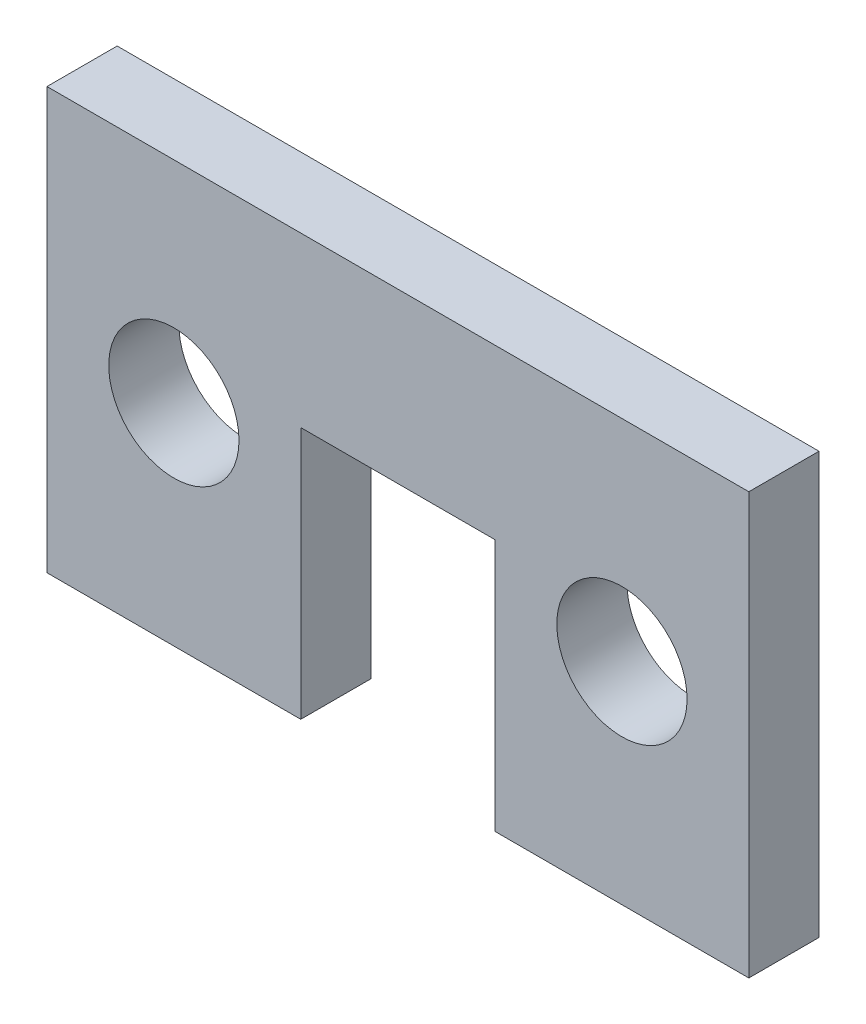
ISO-10303-21;
HEADER;
FILE_DESCRIPTION(('STEP AP214'),'2;1');
FILE_NAME('part.step','',(''),(''),'','','');
FILE_SCHEMA(('AUTOMOTIVE_DESIGN { 1 0 10303 214 1 1 1 1 }'));
ENDSEC;
DATA;
#1=APPLICATION_CONTEXT('core data for automotive mechanical design processes');
#2=APPLICATION_PROTOCOL_DEFINITION('international standard','automotive_design',2000,#1);
#3=PRODUCT_CONTEXT('',#1,'mechanical');
#4=PRODUCT('Part','Part','',(#3));
#5=PRODUCT_RELATED_PRODUCT_CATEGORY('part','',(#4));
#6=PRODUCT_DEFINITION_FORMATION('','',#4);
#7=PRODUCT_DEFINITION_CONTEXT('part definition',#1,'design');
#8=PRODUCT_DEFINITION('design','',#6,#7);
#9=PRODUCT_DEFINITION_SHAPE('','',#8);
#10=(LENGTH_UNIT() NAMED_UNIT(*) SI_UNIT(.MILLI.,.METRE.));
#11=(NAMED_UNIT(*) PLANE_ANGLE_UNIT() SI_UNIT($,.RADIAN.));
#12=(NAMED_UNIT(*) SI_UNIT($,.STERADIAN.) SOLID_ANGLE_UNIT());
#13=UNCERTAINTY_MEASURE_WITH_UNIT(LENGTH_MEASURE(1.E-05),#10,'distance_accuracy_value','');
#14=(GEOMETRIC_REPRESENTATION_CONTEXT(3) GLOBAL_UNCERTAINTY_ASSIGNED_CONTEXT((#13)) GLOBAL_UNIT_ASSIGNED_CONTEXT((#10,
#11,#12)) REPRESENTATION_CONTEXT('',''));
#15=CARTESIAN_POINT('',(0.,0.,0.));
#16=DIRECTION('',(0.,0.,1.));
#17=DIRECTION('',(1.,0.,0.));
#18=AXIS2_PLACEMENT_3D('',#15,#16,#17);
#19=CARTESIAN_POINT('',(-2.19709999999999,2.85749999999999,-1.5875));
#20=DIRECTION('',(-1.,0.,0.));
#21=DIRECTION('',(0.,-1.,0.));
#22=AXIS2_PLACEMENT_3D('',#19,#20,#21);
#23=PLANE('',#22);
#24=DIRECTION('',(0.,1.,0.));
#25=VECTOR('',#24,1.);
#26=CARTESIAN_POINT('',(-2.19709999999999,2.85749999999999,0.));
#27=LINE('',#26,#25);
#28=CARTESIAN_POINT('',(-2.19709999999999,-2.85750000000001,0.));
#29=VERTEX_POINT('',#28);
#30=CARTESIAN_POINT('',(-2.19709999999999,2.85749999999999,0.));
#31=VERTEX_POINT('',#30);
#32=EDGE_CURVE('E128',#29,#31,#27,.T.);
#33=ORIENTED_EDGE('',*,*,#32,.F.);
#34=DIRECTION('',(0.,0.,1.));
#35=VECTOR('',#34,1.);
#36=CARTESIAN_POINT('',(-2.19709999999999,-2.85750000000001,-1.5875));
#37=LINE('',#36,#35);
#38=CARTESIAN_POINT('',(-2.19709999999999,-2.85750000000001,-1.5875));
#39=VERTEX_POINT('',#38);
#40=EDGE_CURVE('E127',#39,#29,#37,.T.);
#41=ORIENTED_EDGE('',*,*,#40,.F.);
#42=DIRECTION('',(0.,1.,0.));
#43=VECTOR('',#42,1.);
#44=CARTESIAN_POINT('',(-2.19709999999999,2.85749999999999,-1.5875));
#45=LINE('',#44,#43);
#46=CARTESIAN_POINT('',(-2.19709999999999,2.85749999999999,-1.5875));
#47=VERTEX_POINT('',#46);
#48=EDGE_CURVE('E147',#39,#47,#45,.T.);
#49=ORIENTED_EDGE('',*,*,#48,.T.);
#50=DIRECTION('',(0.,0.,1.));
#51=VECTOR('',#50,1.);
#52=CARTESIAN_POINT('',(-2.19709999999999,2.85749999999999,-1.5875));
#53=LINE('',#52,#51);
#54=EDGE_CURVE('E11',#47,#31,#53,.T.);
#55=ORIENTED_EDGE('',*,*,#54,.T.);
#56=EDGE_LOOP('',(#33,#41,#49,#55));
#57=FACE_BOUND('',#56,.T.);
#58=ADVANCED_FACE('F32',(#57),#23,.F.);
#59=CARTESIAN_POINT('',(-2.19709999999999,2.85749999999999,-1.5875));
#60=DIRECTION('',(0.,1.,0.));
#61=DIRECTION('',(0.,0.,-1.));
#62=AXIS2_PLACEMENT_3D('',#59,#60,#61);
#63=PLANE('',#62);
#64=DIRECTION('',(1.,0.,0.));
#65=VECTOR('',#64,1.);
#66=CARTESIAN_POINT('',(-2.19709999999999,2.85749999999999,0.));
#67=LINE('',#66,#65);
#68=CARTESIAN_POINT('',(2.19710000000001,2.85749999999999,0.));
#69=VERTEX_POINT('',#68);
#70=EDGE_CURVE('E130',#31,#69,#67,.T.);
#71=ORIENTED_EDGE('',*,*,#70,.F.);
#72=ORIENTED_EDGE('',*,*,#54,.F.);
#73=DIRECTION('',(1.,0.,0.));
#74=VECTOR('',#73,1.);
#75=CARTESIAN_POINT('',(-2.19709999999999,2.85749999999999,-1.5875));
#76=LINE('',#75,#74);
#77=CARTESIAN_POINT('',(2.19710000000001,2.85749999999999,-1.5875));
#78=VERTEX_POINT('',#77);
#79=EDGE_CURVE('E86',#47,#78,#76,.T.);
#80=ORIENTED_EDGE('',*,*,#79,.T.);
#81=DIRECTION('',(0.,0.,1.));
#82=VECTOR('',#81,1.);
#83=CARTESIAN_POINT('',(2.19710000000001,2.85749999999999,-1.5875));
#84=LINE('',#83,#82);
#85=EDGE_CURVE('E40',#78,#69,#84,.T.);
#86=ORIENTED_EDGE('',*,*,#85,.T.);
#87=EDGE_LOOP('',(#71,#72,#80,#86));
#88=FACE_BOUND('',#87,.T.);
#89=ADVANCED_FACE('F159',(#88),#63,.F.);
#90=CARTESIAN_POINT('',(2.19710000000001,2.85749999999999,-1.5875));
#91=DIRECTION('',(1.,0.,0.));
#92=DIRECTION('',(0.,1.,0.));
#93=AXIS2_PLACEMENT_3D('',#90,#91,#92);
#94=PLANE('',#93);
#95=DIRECTION('',(0.,-1.,0.));
#96=VECTOR('',#95,1.);
#97=CARTESIAN_POINT('',(2.19710000000001,2.85749999999999,0.));
#98=LINE('',#97,#96);
#99=CARTESIAN_POINT('',(2.19710000000001,-2.85750000000001,0.));
#100=VERTEX_POINT('',#99);
#101=EDGE_CURVE('E134',#69,#100,#98,.T.);
#102=ORIENTED_EDGE('',*,*,#101,.F.);
#103=ORIENTED_EDGE('',*,*,#85,.F.);
#104=DIRECTION('',(0.,-1.,0.));
#105=VECTOR('',#104,1.);
#106=CARTESIAN_POINT('',(2.19710000000001,2.85749999999999,-1.5875));
#107=LINE('',#106,#105);
#108=CARTESIAN_POINT('',(2.19710000000001,-2.85750000000001,-1.5875));
#109=VERTEX_POINT('',#108);
#110=EDGE_CURVE('E168',#78,#109,#107,.T.);
#111=ORIENTED_EDGE('',*,*,#110,.T.);
#112=DIRECTION('',(0.,0.,1.));
#113=VECTOR('',#112,1.);
#114=CARTESIAN_POINT('',(2.19710000000001,-2.85750000000001,-1.5875));
#115=LINE('',#114,#113);
#116=EDGE_CURVE('E154',#109,#100,#115,.T.);
#117=ORIENTED_EDGE('',*,*,#116,.T.);
#118=EDGE_LOOP('',(#102,#103,#111,#117));
#119=FACE_BOUND('',#118,.T.);
#120=ADVANCED_FACE('F180',(#119),#94,.F.);
#121=CARTESIAN_POINT('',(2.19710000000001,-2.85750000000001,-1.5875));
#122=DIRECTION('',(0.,1.,0.));
#123=DIRECTION('',(-1.,0.,0.));
#124=AXIS2_PLACEMENT_3D('',#121,#122,#123);
#125=PLANE('',#124);
#126=DIRECTION('',(1.,0.,0.));
#127=VECTOR('',#126,1.);
#128=CARTESIAN_POINT('',(2.19710000000001,-2.85750000000001,0.));
#129=LINE('',#128,#127);
#130=CARTESIAN_POINT('',(7.93750000000001,-2.8575,0.));
#131=VERTEX_POINT('',#130);
#132=EDGE_CURVE('E137',#100,#131,#129,.T.);
#133=ORIENTED_EDGE('',*,*,#132,.F.);
#134=ORIENTED_EDGE('',*,*,#116,.F.);
#135=DIRECTION('',(1.,0.,0.));
#136=VECTOR('',#135,1.);
#137=CARTESIAN_POINT('',(2.19710000000001,-2.85750000000001,-1.5875));
#138=LINE('',#137,#136);
#139=CARTESIAN_POINT('',(7.93750000000001,-2.8575,-1.5875));
#140=VERTEX_POINT('',#139);
#141=EDGE_CURVE('E122',#109,#140,#138,.T.);
#142=ORIENTED_EDGE('',*,*,#141,.T.);
#143=DIRECTION('',(0.,0.,1.));
#144=VECTOR('',#143,1.);
#145=CARTESIAN_POINT('',(7.93750000000001,-2.8575,-1.5875));
#146=LINE('',#145,#144);
#147=EDGE_CURVE('E151',#140,#131,#146,.T.);
#148=ORIENTED_EDGE('',*,*,#147,.T.);
#149=EDGE_LOOP('',(#133,#134,#142,#148));
#150=FACE_BOUND('',#149,.T.);
#151=ADVANCED_FACE('F176',(#150),#125,.F.);
#152=CARTESIAN_POINT('',(7.93750000000001,-2.8575,-1.5875));
#153=DIRECTION('',(-1.,0.,0.));
#154=DIRECTION('',(0.,0.,-1.));
#155=AXIS2_PLACEMENT_3D('',#152,#153,#154);
#156=PLANE('',#155);
#157=DIRECTION('',(0.,1.,0.));
#158=VECTOR('',#157,1.);
#159=CARTESIAN_POINT('',(7.93750000000001,-2.8575,0.));
#160=LINE('',#159,#158);
#161=CARTESIAN_POINT('',(7.93750000000001,6.66749999999999,0.));
#162=VERTEX_POINT('',#161);
#163=EDGE_CURVE('E140',#131,#162,#160,.T.);
#164=ORIENTED_EDGE('',*,*,#163,.F.);
#165=ORIENTED_EDGE('',*,*,#147,.F.);
#166=DIRECTION('',(0.,1.,0.));
#167=VECTOR('',#166,1.);
#168=CARTESIAN_POINT('',(7.93750000000001,-2.8575,-1.5875));
#169=LINE('',#168,#167);
#170=CARTESIAN_POINT('',(7.93750000000001,6.66749999999999,-1.5875));
#171=VERTEX_POINT('',#170);
#172=EDGE_CURVE('E120',#140,#171,#169,.T.);
#173=ORIENTED_EDGE('',*,*,#172,.T.);
#174=DIRECTION('',(0.,0.,1.));
#175=VECTOR('',#174,1.);
#176=CARTESIAN_POINT('',(7.93750000000001,6.66749999999999,-1.5875));
#177=LINE('',#176,#175);
#178=EDGE_CURVE('E114',#171,#162,#177,.T.);
#179=ORIENTED_EDGE('',*,*,#178,.T.);
#180=EDGE_LOOP('',(#164,#165,#173,#179));
#181=FACE_BOUND('',#180,.T.);
#182=ADVANCED_FACE('F179',(#181),#156,.F.);
#183=CARTESIAN_POINT('',(-7.93749999999999,6.66749999999999,-1.5875));
#184=DIRECTION('',(0.,-1.,0.));
#185=DIRECTION('',(0.,0.,1.));
#186=AXIS2_PLACEMENT_3D('',#183,#184,#185);
#187=PLANE('',#186);
#188=DIRECTION('',(-1.,0.,0.));
#189=VECTOR('',#188,1.);
#190=CARTESIAN_POINT('',(-7.93749999999999,6.66749999999999,0.));
#191=LINE('',#190,#189);
#192=CARTESIAN_POINT('',(-7.93749999999999,6.66749999999999,0.));
#193=VERTEX_POINT('',#192);
#194=EDGE_CURVE('E143',#162,#193,#191,.T.);
#195=ORIENTED_EDGE('',*,*,#194,.F.);
#196=ORIENTED_EDGE('',*,*,#178,.F.);
#197=DIRECTION('',(-1.,0.,0.));
#198=VECTOR('',#197,1.);
#199=CARTESIAN_POINT('',(-7.93749999999999,6.66749999999999,-1.5875));
#200=LINE('',#199,#198);
#201=CARTESIAN_POINT('',(-7.93749999999999,6.66749999999999,-1.5875));
#202=VERTEX_POINT('',#201);
#203=EDGE_CURVE('E104',#171,#202,#200,.T.);
#204=ORIENTED_EDGE('',*,*,#203,.T.);
#205=DIRECTION('',(0.,0.,1.));
#206=VECTOR('',#205,1.);
#207=CARTESIAN_POINT('',(-7.93749999999999,6.66749999999999,-1.5875));
#208=LINE('',#207,#206);
#209=EDGE_CURVE('E109',#202,#193,#208,.T.);
#210=ORIENTED_EDGE('',*,*,#209,.T.);
#211=EDGE_LOOP('',(#195,#196,#204,#210));
#212=FACE_BOUND('',#211,.T.);
#213=ADVANCED_FACE('F117',(#212),#187,.F.);
#214=CARTESIAN_POINT('',(-7.93749999999999,-2.8575,-1.5875));
#215=DIRECTION('',(1.,0.,0.));
#216=DIRECTION('',(0.,0.,1.));
#217=AXIS2_PLACEMENT_3D('',#214,#215,#216);
#218=PLANE('',#217);
#219=DIRECTION('',(0.,-1.,0.));
#220=VECTOR('',#219,1.);
#221=CARTESIAN_POINT('',(-7.93749999999999,-2.8575,0.));
#222=LINE('',#221,#220);
#223=CARTESIAN_POINT('',(-7.93749999999999,-2.8575,0.));
#224=VERTEX_POINT('',#223);
#225=EDGE_CURVE('E111',#193,#224,#222,.T.);
#226=ORIENTED_EDGE('',*,*,#225,.F.);
#227=ORIENTED_EDGE('',*,*,#209,.F.);
#228=DIRECTION('',(0.,-1.,0.));
#229=VECTOR('',#228,1.);
#230=CARTESIAN_POINT('',(-7.93749999999999,-2.8575,-1.5875));
#231=LINE('',#230,#229);
#232=CARTESIAN_POINT('',(-7.93749999999999,-2.8575,-1.5875));
#233=VERTEX_POINT('',#232);
#234=EDGE_CURVE('E100',#202,#233,#231,.T.);
#235=ORIENTED_EDGE('',*,*,#234,.T.);
#236=DIRECTION('',(0.,0.,1.));
#237=VECTOR('',#236,1.);
#238=CARTESIAN_POINT('',(-7.93749999999999,-2.8575,-1.5875));
#239=LINE('',#238,#237);
#240=EDGE_CURVE('E115',#233,#224,#239,.T.);
#241=ORIENTED_EDGE('',*,*,#240,.T.);
#242=EDGE_LOOP('',(#226,#227,#235,#241));
#243=FACE_BOUND('',#242,.T.);
#244=ADVANCED_FACE('F110',(#243),#218,.F.);
#245=CARTESIAN_POINT('',(-2.19709999999999,-2.85750000000001,-1.5875));
#246=DIRECTION('',(0.,1.,0.));
#247=DIRECTION('',(-1.,0.,0.));
#248=AXIS2_PLACEMENT_3D('',#245,#246,#247);
#249=PLANE('',#248);
#250=DIRECTION('',(1.,0.,0.));
#251=VECTOR('',#250,1.);
#252=CARTESIAN_POINT('',(-2.19709999999999,-2.85750000000001,0.));
#253=LINE('',#252,#251);
#254=EDGE_CURVE('E74',#224,#29,#253,.T.);
#255=ORIENTED_EDGE('',*,*,#254,.F.);
#256=ORIENTED_EDGE('',*,*,#240,.F.);
#257=DIRECTION('',(1.,0.,0.));
#258=VECTOR('',#257,1.);
#259=CARTESIAN_POINT('',(-2.19709999999999,-2.85750000000001,-1.5875));
#260=LINE('',#259,#258);
#261=EDGE_CURVE('E48',#233,#39,#260,.T.);
#262=ORIENTED_EDGE('',*,*,#261,.T.);
#263=ORIENTED_EDGE('',*,*,#40,.T.);
#264=EDGE_LOOP('',(#255,#256,#262,#263));
#265=FACE_BOUND('',#264,.T.);
#266=ADVANCED_FACE('F230',(#265),#249,.F.);
#267=CARTESIAN_POINT('',(-2.19709999999999,-2.85750000000001,-1.5875));
#268=DIRECTION('',(0.,0.,1.));
#269=DIRECTION('',(-1.,0.,0.));
#270=AXIS2_PLACEMENT_3D('',#267,#268,#269);
#271=PLANE('',#270);
#272=CARTESIAN_POINT('',(-5.06729999999999,1.90499999999999,-1.5875));
#273=DIRECTION('',(0.,0.,1.));
#274=DIRECTION('',(1.,0.,0.));
#275=AXIS2_PLACEMENT_3D('',#272,#273,#274);
#276=CIRCLE('',#275,1.47319999999999);
#277=CARTESIAN_POINT('',(-3.5941,1.90499999999999,-1.5875));
#278=VERTEX_POINT('',#277);
#279=EDGE_CURVE('E286',#278,#278,#276,.T.);
#280=ORIENTED_EDGE('',*,*,#279,.T.);
#281=EDGE_LOOP('',(#280));
#282=FACE_BOUND('',#281,.T.);
#283=CARTESIAN_POINT('',(5.06730000000001,1.90499999999999,-1.5875));
#284=DIRECTION('',(0.,0.,1.));
#285=DIRECTION('',(1.,0.,0.));
#286=AXIS2_PLACEMENT_3D('',#283,#284,#285);
#287=CIRCLE('',#286,1.47319999999999);
#288=CARTESIAN_POINT('',(6.5405,1.90499999999999,-1.5875));
#289=VERTEX_POINT('',#288);
#290=EDGE_CURVE('E288',#289,#289,#287,.T.);
#291=ORIENTED_EDGE('',*,*,#290,.T.);
#292=EDGE_LOOP('',(#291));
#293=FACE_BOUND('',#292,.T.);
#294=ORIENTED_EDGE('',*,*,#48,.F.);
#295=ORIENTED_EDGE('',*,*,#261,.F.);
#296=ORIENTED_EDGE('',*,*,#234,.F.);
#297=ORIENTED_EDGE('',*,*,#203,.F.);
#298=ORIENTED_EDGE('',*,*,#172,.F.);
#299=ORIENTED_EDGE('',*,*,#141,.F.);
#300=ORIENTED_EDGE('',*,*,#110,.F.);
#301=ORIENTED_EDGE('',*,*,#79,.F.);
#302=EDGE_LOOP('',(#294,#295,#296,#297,#298,#299,#300,#301));
#303=FACE_BOUND('',#302,.T.);
#304=ADVANCED_FACE('F102',(#282,#293,#303),#271,.F.);
#305=CARTESIAN_POINT('',(-2.19709999999999,-2.85750000000001,0.));
#306=DIRECTION('',(0.,0.,1.));
#307=DIRECTION('',(-1.,0.,0.));
#308=AXIS2_PLACEMENT_3D('',#305,#306,#307);
#309=PLANE('',#308);
#310=CARTESIAN_POINT('',(-5.06729999999999,1.90499999999999,0.));
#311=DIRECTION('',(0.,0.,1.));
#312=DIRECTION('',(1.,0.,0.));
#313=AXIS2_PLACEMENT_3D('',#310,#311,#312);
#314=CIRCLE('',#313,1.4732);
#315=CARTESIAN_POINT('',(-3.59409999999999,1.90499999999999,0.));
#316=VERTEX_POINT('',#315);
#317=EDGE_CURVE('E283',#316,#316,#314,.T.);
#318=ORIENTED_EDGE('',*,*,#317,.F.);
#319=EDGE_LOOP('',(#318));
#320=FACE_BOUND('',#319,.T.);
#321=CARTESIAN_POINT('',(5.06730000000001,1.90499999999999,0.));
#322=DIRECTION('',(0.,0.,1.));
#323=DIRECTION('',(1.,0.,0.));
#324=AXIS2_PLACEMENT_3D('',#321,#322,#323);
#325=CIRCLE('',#324,1.4732);
#326=CARTESIAN_POINT('',(6.54050000000001,1.90499999999999,0.));
#327=VERTEX_POINT('',#326);
#328=EDGE_CURVE('E131',#327,#327,#325,.T.);
#329=ORIENTED_EDGE('',*,*,#328,.F.);
#330=EDGE_LOOP('',(#329));
#331=FACE_BOUND('',#330,.T.);
#332=ORIENTED_EDGE('',*,*,#32,.T.);
#333=ORIENTED_EDGE('',*,*,#70,.T.);
#334=ORIENTED_EDGE('',*,*,#101,.T.);
#335=ORIENTED_EDGE('',*,*,#132,.T.);
#336=ORIENTED_EDGE('',*,*,#163,.T.);
#337=ORIENTED_EDGE('',*,*,#194,.T.);
#338=ORIENTED_EDGE('',*,*,#225,.T.);
#339=ORIENTED_EDGE('',*,*,#254,.T.);
#340=EDGE_LOOP('',(#332,#333,#334,#335,#336,#337,#338,#339));
#341=FACE_BOUND('',#340,.T.);
#342=ADVANCED_FACE('F162',(#320,#331,#341),#309,.T.);
#343=CARTESIAN_POINT('',(5.06730000000001,1.90499999999999,-1.5875));
#344=DIRECTION('',(0.,0.,-1.));
#345=DIRECTION('',(1.,0.,0.));
#346=AXIS2_PLACEMENT_3D('',#343,#344,#345);
#347=CYLINDRICAL_SURFACE('',#346,1.47319999999999);
#348=ORIENTED_EDGE('',*,*,#328,.T.);
#349=EDGE_LOOP('',(#348));
#350=FACE_BOUND('',#349,.T.);
#351=ORIENTED_EDGE('',*,*,#290,.F.);
#352=EDGE_LOOP('',(#351));
#353=FACE_BOUND('',#352,.T.);
#354=ADVANCED_FACE('F256',(#350,#353),#347,.F.);
#355=CARTESIAN_POINT('',(-5.06729999999999,1.90499999999999,-1.5875));
#356=DIRECTION('',(0.,0.,-1.));
#357=DIRECTION('',(1.,0.,0.));
#358=AXIS2_PLACEMENT_3D('',#355,#356,#357);
#359=CYLINDRICAL_SURFACE('',#358,1.47319999999999);
#360=ORIENTED_EDGE('',*,*,#317,.T.);
#361=EDGE_LOOP('',(#360));
#362=FACE_BOUND('',#361,.T.);
#363=ORIENTED_EDGE('',*,*,#279,.F.);
#364=EDGE_LOOP('',(#363));
#365=FACE_BOUND('',#364,.T.);
#366=ADVANCED_FACE('F266',(#362,#365),#359,.F.);
#367=CLOSED_SHELL('',(#58,#89,#120,#151,#182,#213,#244,#266,#304,#342,#354,#366));
#368=MANIFOLD_SOLID_BREP('B2',#367);
#369=ADVANCED_BREP_SHAPE_REPRESENTATION('',(#18,#368),#14);
#370=SHAPE_DEFINITION_REPRESENTATION(#9,#369);
ENDSEC;
END-ISO-10303-21;
